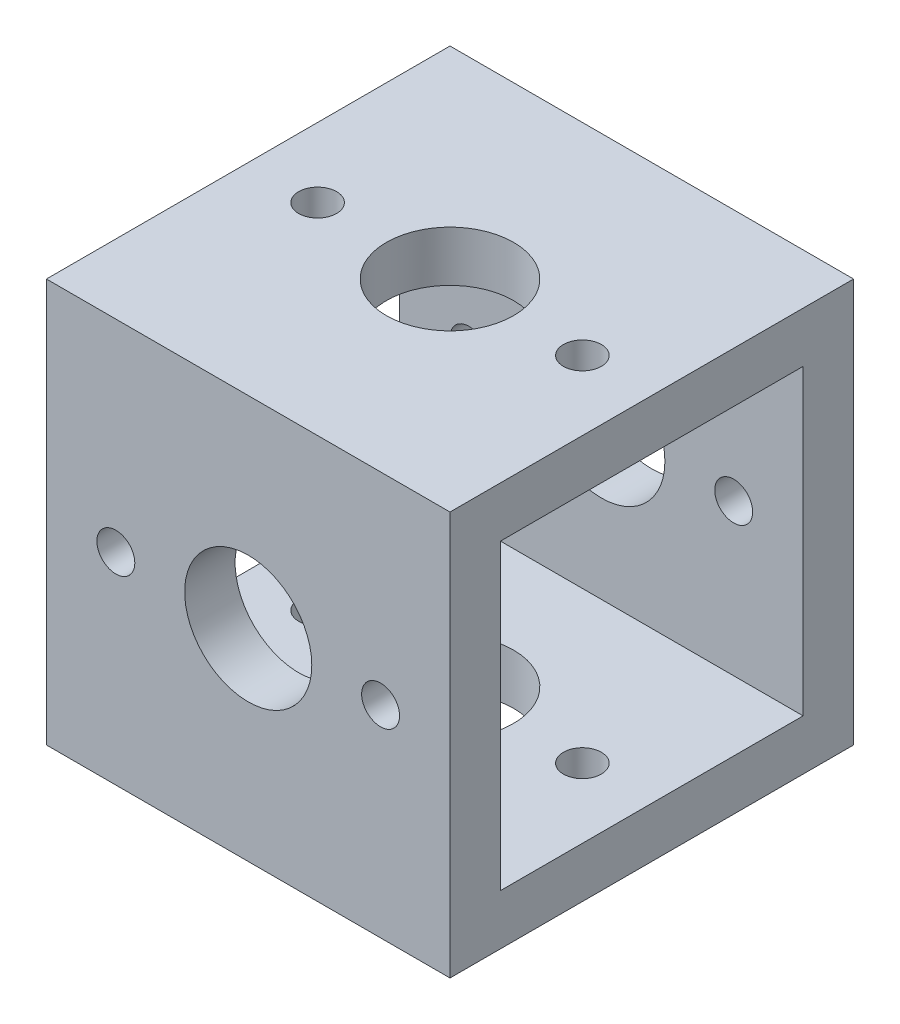
ISO-10303-21;
HEADER;
FILE_DESCRIPTION(('STEP AP214'),'2;1');
FILE_NAME('part.step','',(''),(''),'','','');
FILE_SCHEMA(('AUTOMOTIVE_DESIGN { 1 0 10303 214 1 1 1 1 }'));
ENDSEC;
DATA;
#1=APPLICATION_CONTEXT('core data for automotive mechanical design processes');
#2=APPLICATION_PROTOCOL_DEFINITION('international standard','automotive_design',2000,#1);
#3=PRODUCT_CONTEXT('',#1,'mechanical');
#4=PRODUCT('Part','Part','',(#3));
#5=PRODUCT_RELATED_PRODUCT_CATEGORY('part','',(#4));
#6=PRODUCT_DEFINITION_FORMATION('','',#4);
#7=PRODUCT_DEFINITION_CONTEXT('part definition',#1,'design');
#8=PRODUCT_DEFINITION('design','',#6,#7);
#9=PRODUCT_DEFINITION_SHAPE('','',#8);
#10=(LENGTH_UNIT() NAMED_UNIT(*) SI_UNIT(.MILLI.,.METRE.));
#11=(NAMED_UNIT(*) PLANE_ANGLE_UNIT() SI_UNIT($,.RADIAN.));
#12=(NAMED_UNIT(*) SI_UNIT($,.STERADIAN.) SOLID_ANGLE_UNIT());
#13=UNCERTAINTY_MEASURE_WITH_UNIT(LENGTH_MEASURE(1.E-05),#10,'distance_accuracy_value','');
#14=(GEOMETRIC_REPRESENTATION_CONTEXT(3) GLOBAL_UNCERTAINTY_ASSIGNED_CONTEXT((#13)) GLOBAL_UNIT_ASSIGNED_CONTEXT((#10,
#11,#12)) REPRESENTATION_CONTEXT('',''));
#15=CARTESIAN_POINT('',(0.,0.,0.));
#16=DIRECTION('',(0.,0.,1.));
#17=DIRECTION('',(1.,0.,0.));
#18=AXIS2_PLACEMENT_3D('',#15,#16,#17);
#19=CARTESIAN_POINT('',(25.4,11.9126,2.3876));
#20=DIRECTION('',(0.,0.,1.));
#21=DIRECTION('',(1.,0.,0.));
#22=AXIS2_PLACEMENT_3D('',#19,#20,#21);
#23=PLANE('',#22);
#24=CARTESIAN_POINT('',(21.0312,11.9126,2.3876));
#25=DIRECTION('',(0.,0.,1.));
#26=DIRECTION('',(1.,0.,0.));
#27=AXIS2_PLACEMENT_3D('',#24,#25,#26);
#28=CIRCLE('',#27,1.1938);
#29=CARTESIAN_POINT('',(22.225,11.9126,2.3876));
#30=VERTEX_POINT('',#29);
#31=EDGE_CURVE('E259',#30,#30,#28,.F.);
#32=ORIENTED_EDGE('',*,*,#31,.T.);
#33=EDGE_LOOP('',(#32));
#34=FACE_BOUND('',#33,.T.);
#35=DIRECTION('',(0.,1.,0.));
#36=VECTOR('',#35,1.);
#37=CARTESIAN_POINT('',(0.,11.9126,2.3876));
#38=LINE('',#37,#36);
#39=CARTESIAN_POINT('',(0.,2.3876,2.3876));
#40=VERTEX_POINT('',#39);
#41=CARTESIAN_POINT('',(0.,21.4376,2.3876));
#42=VERTEX_POINT('',#41);
#43=EDGE_CURVE('E130',#40,#42,#38,.T.);
#44=ORIENTED_EDGE('',*,*,#43,.F.);
#45=DIRECTION('',(-1.,0.,0.));
#46=VECTOR('',#45,1.);
#47=CARTESIAN_POINT('',(25.4,2.3876,2.3876));
#48=LINE('',#47,#46);
#49=CARTESIAN_POINT('',(25.4,2.3876,2.3876));
#50=VERTEX_POINT('',#49);
#51=EDGE_CURVE('E11',#50,#40,#48,.T.);
#52=ORIENTED_EDGE('',*,*,#51,.F.);
#53=DIRECTION('',(0.,1.,0.));
#54=VECTOR('',#53,1.);
#55=CARTESIAN_POINT('',(25.4,11.9126,2.3876));
#56=LINE('',#55,#54);
#57=CARTESIAN_POINT('',(25.4,21.4376,2.3876));
#58=VERTEX_POINT('',#57);
#59=EDGE_CURVE('E150',#50,#58,#56,.T.);
#60=ORIENTED_EDGE('',*,*,#59,.T.);
#61=DIRECTION('',(-1.,0.,0.));
#62=VECTOR('',#61,1.);
#63=CARTESIAN_POINT('',(25.4,21.4376,2.3876));
#64=LINE('',#63,#62);
#65=EDGE_CURVE('E43',#58,#42,#64,.T.);
#66=ORIENTED_EDGE('',*,*,#65,.T.);
#67=EDGE_LOOP('',(#44,#52,#60,#66));
#68=FACE_BOUND('',#67,.T.);
#69=CARTESIAN_POINT('',(12.7,11.9126,2.3876));
#70=DIRECTION('',(0.,0.,1.));
#71=DIRECTION('',(1.,0.,0.));
#72=AXIS2_PLACEMENT_3D('',#69,#70,#71);
#73=CIRCLE('',#72,4.0005);
#74=CARTESIAN_POINT('',(16.7005,11.9126,2.3876));
#75=VERTEX_POINT('',#74);
#76=EDGE_CURVE('E276',#75,#75,#73,.F.);
#77=ORIENTED_EDGE('',*,*,#76,.T.);
#78=EDGE_LOOP('',(#77));
#79=FACE_BOUND('',#78,.T.);
#80=CARTESIAN_POINT('',(4.3688,11.9126,2.3876));
#81=DIRECTION('',(0.,0.,1.));
#82=DIRECTION('',(1.,0.,0.));
#83=AXIS2_PLACEMENT_3D('',#80,#81,#82);
#84=CIRCLE('',#83,1.1938);
#85=CARTESIAN_POINT('',(5.5626,11.9126,2.3876));
#86=VERTEX_POINT('',#85);
#87=EDGE_CURVE('E262',#86,#86,#84,.F.);
#88=ORIENTED_EDGE('',*,*,#87,.T.);
#89=EDGE_LOOP('',(#88));
#90=FACE_BOUND('',#89,.T.);
#91=ADVANCED_FACE('F26',(#34,#68,#79,#90),#23,.T.);
#92=CARTESIAN_POINT('',(25.4,11.9126,21.4376));
#93=DIRECTION('',(0.,0.,1.));
#94=DIRECTION('',(1.,0.,0.));
#95=AXIS2_PLACEMENT_3D('',#92,#93,#94);
#96=PLANE('',#95);
#97=CARTESIAN_POINT('',(21.0312,11.9126,21.4376));
#98=DIRECTION('',(0.,0.,1.));
#99=DIRECTION('',(1.,0.,0.));
#100=AXIS2_PLACEMENT_3D('',#97,#98,#99);
#101=CIRCLE('',#100,1.1938);
#102=CARTESIAN_POINT('',(22.225,11.9126,21.4376));
#103=VERTEX_POINT('',#102);
#104=EDGE_CURVE('E255',#103,#103,#101,.F.);
#105=ORIENTED_EDGE('',*,*,#104,.F.);
#106=EDGE_LOOP('',(#105));
#107=FACE_BOUND('',#106,.T.);
#108=DIRECTION('',(0.,1.,0.));
#109=VECTOR('',#108,1.);
#110=CARTESIAN_POINT('',(0.,11.9126,21.4376));
#111=LINE('',#110,#109);
#112=CARTESIAN_POINT('',(0.,2.3876,21.4376));
#113=VERTEX_POINT('',#112);
#114=CARTESIAN_POINT('',(0.,21.4376,21.4376));
#115=VERTEX_POINT('',#114);
#116=EDGE_CURVE('E136',#113,#115,#111,.T.);
#117=ORIENTED_EDGE('',*,*,#116,.T.);
#118=DIRECTION('',(-1.,0.,0.));
#119=VECTOR('',#118,1.);
#120=CARTESIAN_POINT('',(25.4,21.4376,21.4376));
#121=LINE('',#120,#119);
#122=CARTESIAN_POINT('',(25.4,21.4376,21.4376));
#123=VERTEX_POINT('',#122);
#124=EDGE_CURVE('E158',#123,#115,#121,.T.);
#125=ORIENTED_EDGE('',*,*,#124,.F.);
#126=DIRECTION('',(0.,1.,0.));
#127=VECTOR('',#126,1.);
#128=CARTESIAN_POINT('',(25.4,11.9126,21.4376));
#129=LINE('',#128,#127);
#130=CARTESIAN_POINT('',(25.4,2.3876,21.4376));
#131=VERTEX_POINT('',#130);
#132=EDGE_CURVE('E51',#131,#123,#129,.T.);
#133=ORIENTED_EDGE('',*,*,#132,.F.);
#134=DIRECTION('',(-1.,0.,0.));
#135=VECTOR('',#134,1.);
#136=CARTESIAN_POINT('',(25.4,2.3876,21.4376));
#137=LINE('',#136,#135);
#138=EDGE_CURVE('E35',#131,#113,#137,.T.);
#139=ORIENTED_EDGE('',*,*,#138,.T.);
#140=EDGE_LOOP('',(#117,#125,#133,#139));
#141=FACE_BOUND('',#140,.T.);
#142=CARTESIAN_POINT('',(12.7,11.9126,21.4376));
#143=DIRECTION('',(0.,0.,1.));
#144=DIRECTION('',(1.,0.,0.));
#145=AXIS2_PLACEMENT_3D('',#142,#143,#144);
#146=CIRCLE('',#145,4.0005);
#147=CARTESIAN_POINT('',(16.7005,11.9126,21.4376));
#148=VERTEX_POINT('',#147);
#149=EDGE_CURVE('E273',#148,#148,#146,.F.);
#150=ORIENTED_EDGE('',*,*,#149,.F.);
#151=EDGE_LOOP('',(#150));
#152=FACE_BOUND('',#151,.T.);
#153=CARTESIAN_POINT('',(4.3688,11.9126,21.4376));
#154=DIRECTION('',(0.,0.,1.));
#155=DIRECTION('',(1.,0.,0.));
#156=AXIS2_PLACEMENT_3D('',#153,#154,#155);
#157=CIRCLE('',#156,1.1938);
#158=CARTESIAN_POINT('',(5.5626,11.9126,21.4376));
#159=VERTEX_POINT('',#158);
#160=EDGE_CURVE('E325',#159,#159,#157,.F.);
#161=ORIENTED_EDGE('',*,*,#160,.F.);
#162=EDGE_LOOP('',(#161));
#163=FACE_BOUND('',#162,.T.);
#164=ADVANCED_FACE('F229',(#107,#141,#152,#163),#96,.F.);
#165=CARTESIAN_POINT('',(25.4,11.9126,-0.787399999999997));
#166=DIRECTION('',(0.,0.,1.));
#167=DIRECTION('',(0.,-1.,0.));
#168=AXIS2_PLACEMENT_3D('',#165,#166,#167);
#169=PLANE('',#168);
#170=CARTESIAN_POINT('',(21.0312,11.9126,-0.787399999999997));
#171=DIRECTION('',(0.,0.,1.));
#172=DIRECTION('',(0.,-1.,0.));
#173=AXIS2_PLACEMENT_3D('',#170,#171,#172);
#174=CIRCLE('',#173,1.1938);
#175=CARTESIAN_POINT('',(21.0312,10.7188,-0.787399999999997));
#176=VERTEX_POINT('',#175);
#177=EDGE_CURVE('E253',#176,#176,#174,.F.);
#178=ORIENTED_EDGE('',*,*,#177,.F.);
#179=EDGE_LOOP('',(#178));
#180=FACE_BOUND('',#179,.T.);
#181=DIRECTION('',(0.,1.,0.));
#182=VECTOR('',#181,1.);
#183=CARTESIAN_POINT('',(0.,11.9126,-0.787399999999997));
#184=LINE('',#183,#182);
#185=CARTESIAN_POINT('',(0.,-0.787399999999997,-0.787399999999997));
#186=VERTEX_POINT('',#185);
#187=CARTESIAN_POINT('',(0.,24.6126,-0.787399999999999));
#188=VERTEX_POINT('',#187);
#189=EDGE_CURVE('E98',#186,#188,#184,.T.);
#190=ORIENTED_EDGE('',*,*,#189,.T.);
#191=DIRECTION('',(-1.,0.,0.));
#192=VECTOR('',#191,1.);
#193=CARTESIAN_POINT('',(25.4,24.6126,-0.787399999999999));
#194=LINE('',#193,#192);
#195=CARTESIAN_POINT('',(25.4,24.6126,-0.787399999999999));
#196=VERTEX_POINT('',#195);
#197=EDGE_CURVE('E105',#196,#188,#194,.T.);
#198=ORIENTED_EDGE('',*,*,#197,.F.);
#199=DIRECTION('',(0.,1.,0.));
#200=VECTOR('',#199,1.);
#201=CARTESIAN_POINT('',(25.4,11.9126,-0.787399999999997));
#202=LINE('',#201,#200);
#203=CARTESIAN_POINT('',(25.4,-0.787399999999997,-0.787399999999997));
#204=VERTEX_POINT('',#203);
#205=EDGE_CURVE('E100',#204,#196,#202,.T.);
#206=ORIENTED_EDGE('',*,*,#205,.F.);
#207=DIRECTION('',(-1.,0.,0.));
#208=VECTOR('',#207,1.);
#209=CARTESIAN_POINT('',(25.4,-0.787399999999997,-0.787399999999997));
#210=LINE('',#209,#208);
#211=EDGE_CURVE('E93',#204,#186,#210,.T.);
#212=ORIENTED_EDGE('',*,*,#211,.T.);
#213=EDGE_LOOP('',(#190,#198,#206,#212));
#214=FACE_BOUND('',#213,.T.);
#215=CARTESIAN_POINT('',(12.7,11.9126,-0.787399999999997));
#216=DIRECTION('',(0.,0.,1.));
#217=DIRECTION('',(0.,-1.,0.));
#218=AXIS2_PLACEMENT_3D('',#215,#216,#217);
#219=CIRCLE('',#218,4.0005);
#220=CARTESIAN_POINT('',(12.7,7.9121,-0.787399999999997));
#221=VERTEX_POINT('',#220);
#222=EDGE_CURVE('E270',#221,#221,#219,.F.);
#223=ORIENTED_EDGE('',*,*,#222,.F.);
#224=EDGE_LOOP('',(#223));
#225=FACE_BOUND('',#224,.T.);
#226=CARTESIAN_POINT('',(4.3688,11.9126,-0.787399999999997));
#227=DIRECTION('',(0.,0.,1.));
#228=DIRECTION('',(0.,-1.,0.));
#229=AXIS2_PLACEMENT_3D('',#226,#227,#228);
#230=CIRCLE('',#229,1.1938);
#231=CARTESIAN_POINT('',(4.3688,10.7188,-0.787399999999997));
#232=VERTEX_POINT('',#231);
#233=EDGE_CURVE('E327',#232,#232,#230,.F.);
#234=ORIENTED_EDGE('',*,*,#233,.F.);
#235=EDGE_LOOP('',(#234));
#236=FACE_BOUND('',#235,.T.);
#237=ADVANCED_FACE('F95',(#180,#214,#225,#236),#169,.F.);
#238=CARTESIAN_POINT('',(25.4,11.9126,24.6126));
#239=DIRECTION('',(0.,0.,1.));
#240=DIRECTION('',(1.,0.,0.));
#241=AXIS2_PLACEMENT_3D('',#238,#239,#240);
#242=PLANE('',#241);
#243=CARTESIAN_POINT('',(21.0312,11.9126,24.6126));
#244=DIRECTION('',(0.,0.,1.));
#245=DIRECTION('',(1.,0.,0.));
#246=AXIS2_PLACEMENT_3D('',#243,#244,#245);
#247=CIRCLE('',#246,1.1938);
#248=CARTESIAN_POINT('',(22.225,11.9126,24.6126));
#249=VERTEX_POINT('',#248);
#250=EDGE_CURVE('E256',#249,#249,#247,.T.);
#251=ORIENTED_EDGE('',*,*,#250,.F.);
#252=EDGE_LOOP('',(#251));
#253=FACE_BOUND('',#252,.T.);
#254=DIRECTION('',(0.,1.,0.));
#255=VECTOR('',#254,1.);
#256=CARTESIAN_POINT('',(0.,11.9126,24.6126));
#257=LINE('',#256,#255);
#258=CARTESIAN_POINT('',(0.,-0.787400000000001,24.6126));
#259=VERTEX_POINT('',#258);
#260=CARTESIAN_POINT('',(0.,24.6126,24.6126));
#261=VERTEX_POINT('',#260);
#262=EDGE_CURVE('E128',#259,#261,#257,.T.);
#263=ORIENTED_EDGE('',*,*,#262,.F.);
#264=DIRECTION('',(-1.,0.,0.));
#265=VECTOR('',#264,1.);
#266=CARTESIAN_POINT('',(25.4,-0.787400000000001,24.6126));
#267=LINE('',#266,#265);
#268=CARTESIAN_POINT('',(25.4,-0.787400000000001,24.6126));
#269=VERTEX_POINT('',#268);
#270=EDGE_CURVE('E119',#269,#259,#267,.T.);
#271=ORIENTED_EDGE('',*,*,#270,.F.);
#272=DIRECTION('',(0.,1.,0.));
#273=VECTOR('',#272,1.);
#274=CARTESIAN_POINT('',(25.4,11.9126,24.6126));
#275=LINE('',#274,#273);
#276=CARTESIAN_POINT('',(25.4,24.6126,24.6126));
#277=VERTEX_POINT('',#276);
#278=EDGE_CURVE('E147',#269,#277,#275,.T.);
#279=ORIENTED_EDGE('',*,*,#278,.T.);
#280=DIRECTION('',(-1.,0.,0.));
#281=VECTOR('',#280,1.);
#282=CARTESIAN_POINT('',(25.4,24.6126,24.6126));
#283=LINE('',#282,#281);
#284=EDGE_CURVE('E163',#277,#261,#283,.T.);
#285=ORIENTED_EDGE('',*,*,#284,.T.);
#286=EDGE_LOOP('',(#263,#271,#279,#285));
#287=FACE_BOUND('',#286,.T.);
#288=CARTESIAN_POINT('',(12.7,11.9126,24.6126));
#289=DIRECTION('',(0.,0.,1.));
#290=DIRECTION('',(1.,0.,0.));
#291=AXIS2_PLACEMENT_3D('',#288,#289,#290);
#292=CIRCLE('',#291,4.0005);
#293=CARTESIAN_POINT('',(16.7005,11.9126,24.6126));
#294=VERTEX_POINT('',#293);
#295=EDGE_CURVE('E267',#294,#294,#292,.T.);
#296=ORIENTED_EDGE('',*,*,#295,.F.);
#297=EDGE_LOOP('',(#296));
#298=FACE_BOUND('',#297,.T.);
#299=CARTESIAN_POINT('',(4.3688,11.9126,24.6126));
#300=DIRECTION('',(0.,0.,1.));
#301=DIRECTION('',(1.,0.,0.));
#302=AXIS2_PLACEMENT_3D('',#299,#300,#301);
#303=CIRCLE('',#302,1.1938);
#304=CARTESIAN_POINT('',(5.5626,11.9126,24.6126));
#305=VERTEX_POINT('',#304);
#306=EDGE_CURVE('E331',#305,#305,#303,.T.);
#307=ORIENTED_EDGE('',*,*,#306,.F.);
#308=EDGE_LOOP('',(#307));
#309=FACE_BOUND('',#308,.T.);
#310=ADVANCED_FACE('F206',(#253,#287,#298,#309),#242,.T.);
#311=CARTESIAN_POINT('',(25.4,2.3876,-16.1688213562373));
#312=DIRECTION('',(0.,-1.,0.));
#313=DIRECTION('',(0.,0.,-1.));
#314=AXIS2_PLACEMENT_3D('',#311,#312,#313);
#315=PLANE('',#314);
#316=CARTESIAN_POINT('',(21.0312,2.3876,11.9126));
#317=DIRECTION('',(0.,-1.,0.));
#318=DIRECTION('',(0.,0.,-1.));
#319=AXIS2_PLACEMENT_3D('',#316,#317,#318);
#320=CIRCLE('',#319,1.1938);
#321=CARTESIAN_POINT('',(21.0312,2.3876,10.7188));
#322=VERTEX_POINT('',#321);
#323=EDGE_CURVE('E176',#322,#322,#320,.F.);
#324=ORIENTED_EDGE('',*,*,#323,.F.);
#325=EDGE_LOOP('',(#324));
#326=FACE_BOUND('',#325,.T.);
#327=DIRECTION('',(0.,0.,1.));
#328=VECTOR('',#327,1.);
#329=CARTESIAN_POINT('',(0.,2.3876,-16.1688213562373));
#330=LINE('',#329,#328);
#331=EDGE_CURVE('E133',#40,#113,#330,.T.);
#332=ORIENTED_EDGE('',*,*,#331,.T.);
#333=ORIENTED_EDGE('',*,*,#138,.F.);
#334=DIRECTION('',(0.,0.,1.));
#335=VECTOR('',#334,1.);
#336=CARTESIAN_POINT('',(25.4,2.3876,-16.1688213562373));
#337=LINE('',#336,#335);
#338=EDGE_CURVE('E152',#50,#131,#337,.T.);
#339=ORIENTED_EDGE('',*,*,#338,.F.);
#340=ORIENTED_EDGE('',*,*,#51,.T.);
#341=EDGE_LOOP('',(#332,#333,#339,#340));
#342=FACE_BOUND('',#341,.T.);
#343=CARTESIAN_POINT('',(12.7,2.3876,11.9126));
#344=DIRECTION('',(0.,-1.,0.));
#345=DIRECTION('',(0.,0.,-1.));
#346=AXIS2_PLACEMENT_3D('',#343,#344,#345);
#347=CIRCLE('',#346,4.0005);
#348=CARTESIAN_POINT('',(12.7,2.3876,7.9121));
#349=VERTEX_POINT('',#348);
#350=EDGE_CURVE('E120',#349,#349,#347,.F.);
#351=ORIENTED_EDGE('',*,*,#350,.F.);
#352=EDGE_LOOP('',(#351));
#353=FACE_BOUND('',#352,.T.);
#354=CARTESIAN_POINT('',(4.3688,2.3876,11.9126));
#355=DIRECTION('',(0.,-1.,0.));
#356=DIRECTION('',(0.,0.,-1.));
#357=AXIS2_PLACEMENT_3D('',#354,#355,#356);
#358=CIRCLE('',#357,1.1938);
#359=CARTESIAN_POINT('',(4.3688,2.3876,10.7188));
#360=VERTEX_POINT('',#359);
#361=EDGE_CURVE('E179',#360,#360,#358,.F.);
#362=ORIENTED_EDGE('',*,*,#361,.F.);
#363=EDGE_LOOP('',(#362));
#364=FACE_BOUND('',#363,.T.);
#365=ADVANCED_FACE('F203',(#326,#342,#353,#364),#315,.F.);
#366=CARTESIAN_POINT('',(25.4,-0.787399999999995,-16.1688213562373));
#367=DIRECTION('',(0.,-1.,0.));
#368=DIRECTION('',(0.,0.,-1.));
#369=AXIS2_PLACEMENT_3D('',#366,#367,#368);
#370=PLANE('',#369);
#371=CARTESIAN_POINT('',(21.0312,-0.787400000000001,11.9126));
#372=DIRECTION('',(0.,-1.,0.));
#373=DIRECTION('',(0.,0.,-1.));
#374=AXIS2_PLACEMENT_3D('',#371,#372,#373);
#375=CIRCLE('',#374,1.1938);
#376=CARTESIAN_POINT('',(21.0312,-0.787400000000001,10.7188));
#377=VERTEX_POINT('',#376);
#378=EDGE_CURVE('E171',#377,#377,#375,.F.);
#379=ORIENTED_EDGE('',*,*,#378,.T.);
#380=EDGE_LOOP('',(#379));
#381=FACE_BOUND('',#380,.T.);
#382=DIRECTION('',(0.,0.,1.));
#383=VECTOR('',#382,1.);
#384=CARTESIAN_POINT('',(0.,-0.787399999999995,-16.1688213562373));
#385=LINE('',#384,#383);
#386=EDGE_CURVE('E113',#186,#259,#385,.T.);
#387=ORIENTED_EDGE('',*,*,#386,.F.);
#388=ORIENTED_EDGE('',*,*,#211,.F.);
#389=DIRECTION('',(0.,0.,1.));
#390=VECTOR('',#389,1.);
#391=CARTESIAN_POINT('',(25.4,-0.787399999999995,-16.1688213562373));
#392=LINE('',#391,#390);
#393=EDGE_CURVE('E142',#204,#269,#392,.T.);
#394=ORIENTED_EDGE('',*,*,#393,.T.);
#395=ORIENTED_EDGE('',*,*,#270,.T.);
#396=EDGE_LOOP('',(#387,#388,#394,#395));
#397=FACE_BOUND('',#396,.T.);
#398=CARTESIAN_POINT('',(12.7,-0.787400000000001,11.9126));
#399=DIRECTION('',(0.,-1.,0.));
#400=DIRECTION('',(0.,0.,-1.));
#401=AXIS2_PLACEMENT_3D('',#398,#399,#400);
#402=CIRCLE('',#401,4.0005);
#403=CARTESIAN_POINT('',(12.7,-0.7874,7.9121));
#404=VERTEX_POINT('',#403);
#405=EDGE_CURVE('E123',#404,#404,#402,.F.);
#406=ORIENTED_EDGE('',*,*,#405,.T.);
#407=EDGE_LOOP('',(#406));
#408=FACE_BOUND('',#407,.T.);
#409=CARTESIAN_POINT('',(4.3688,-0.787400000000001,11.9126));
#410=DIRECTION('',(0.,-1.,0.));
#411=DIRECTION('',(0.,0.,-1.));
#412=AXIS2_PLACEMENT_3D('',#409,#410,#411);
#413=CIRCLE('',#412,1.1938);
#414=CARTESIAN_POINT('',(4.3688,-0.787400000000001,10.7188));
#415=VERTEX_POINT('',#414);
#416=EDGE_CURVE('E184',#415,#415,#413,.F.);
#417=ORIENTED_EDGE('',*,*,#416,.T.);
#418=EDGE_LOOP('',(#417));
#419=FACE_BOUND('',#418,.T.);
#420=ADVANCED_FACE('F28',(#381,#397,#408,#419),#370,.T.);
#421=CARTESIAN_POINT('',(25.4,24.6126,-16.1688213562373));
#422=DIRECTION('',(0.,-1.,0.));
#423=DIRECTION('',(0.,0.,-1.));
#424=AXIS2_PLACEMENT_3D('',#421,#422,#423);
#425=PLANE('',#424);
#426=CARTESIAN_POINT('',(21.0312,24.6126,11.9126));
#427=DIRECTION('',(0.,1.,0.));
#428=DIRECTION('',(0.,0.,1.));
#429=AXIS2_PLACEMENT_3D('',#426,#427,#428);
#430=CIRCLE('',#429,1.1938);
#431=CARTESIAN_POINT('',(21.0312,24.6126,13.1064));
#432=VERTEX_POINT('',#431);
#433=EDGE_CURVE('E172',#432,#432,#430,.T.);
#434=ORIENTED_EDGE('',*,*,#433,.F.);
#435=EDGE_LOOP('',(#434));
#436=FACE_BOUND('',#435,.T.);
#437=DIRECTION('',(0.,0.,1.));
#438=VECTOR('',#437,1.);
#439=CARTESIAN_POINT('',(0.,24.6126,-16.1688213562373));
#440=LINE('',#439,#438);
#441=EDGE_CURVE('E116',#188,#261,#440,.T.);
#442=ORIENTED_EDGE('',*,*,#441,.T.);
#443=ORIENTED_EDGE('',*,*,#284,.F.);
#444=DIRECTION('',(0.,0.,1.));
#445=VECTOR('',#444,1.);
#446=CARTESIAN_POINT('',(25.4,24.6126,-16.1688213562373));
#447=LINE('',#446,#445);
#448=EDGE_CURVE('E145',#196,#277,#447,.T.);
#449=ORIENTED_EDGE('',*,*,#448,.F.);
#450=ORIENTED_EDGE('',*,*,#197,.T.);
#451=EDGE_LOOP('',(#442,#443,#449,#450));
#452=FACE_BOUND('',#451,.T.);
#453=CARTESIAN_POINT('',(12.7,24.6126,11.9126));
#454=DIRECTION('',(0.,1.,0.));
#455=DIRECTION('',(0.,0.,1.));
#456=AXIS2_PLACEMENT_3D('',#453,#454,#455);
#457=CIRCLE('',#456,4.0005);
#458=CARTESIAN_POINT('',(12.7,24.6126,15.9131));
#459=VERTEX_POINT('',#458);
#460=EDGE_CURVE('E168',#459,#459,#457,.T.);
#461=ORIENTED_EDGE('',*,*,#460,.F.);
#462=EDGE_LOOP('',(#461));
#463=FACE_BOUND('',#462,.T.);
#464=CARTESIAN_POINT('',(4.3688,24.6126,11.9126));
#465=DIRECTION('',(0.,1.,0.));
#466=DIRECTION('',(0.,0.,1.));
#467=AXIS2_PLACEMENT_3D('',#464,#465,#466);
#468=CIRCLE('',#467,1.1938);
#469=CARTESIAN_POINT('',(4.3688,24.6126,13.1064));
#470=VERTEX_POINT('',#469);
#471=EDGE_CURVE('E279',#470,#470,#468,.T.);
#472=ORIENTED_EDGE('',*,*,#471,.F.);
#473=EDGE_LOOP('',(#472));
#474=FACE_BOUND('',#473,.T.);
#475=ADVANCED_FACE('F243',(#436,#452,#463,#474),#425,.F.);
#476=CARTESIAN_POINT('',(25.4,21.4376,-16.1688213562373));
#477=DIRECTION('',(0.,-1.,0.));
#478=DIRECTION('',(0.,0.,-1.));
#479=AXIS2_PLACEMENT_3D('',#476,#477,#478);
#480=PLANE('',#479);
#481=CARTESIAN_POINT('',(21.0312,21.4376,11.9126));
#482=DIRECTION('',(0.,-1.,0.));
#483=DIRECTION('',(0.,0.,-1.));
#484=AXIS2_PLACEMENT_3D('',#481,#482,#483);
#485=CIRCLE('',#484,1.1938);
#486=CARTESIAN_POINT('',(21.0312,21.4376,10.7188));
#487=VERTEX_POINT('',#486);
#488=EDGE_CURVE('E169',#487,#487,#485,.F.);
#489=ORIENTED_EDGE('',*,*,#488,.T.);
#490=EDGE_LOOP('',(#489));
#491=FACE_BOUND('',#490,.T.);
#492=DIRECTION('',(0.,0.,1.));
#493=VECTOR('',#492,1.);
#494=CARTESIAN_POINT('',(0.,21.4376,-16.1688213562373));
#495=LINE('',#494,#493);
#496=EDGE_CURVE('E139',#42,#115,#495,.T.);
#497=ORIENTED_EDGE('',*,*,#496,.F.);
#498=ORIENTED_EDGE('',*,*,#65,.F.);
#499=DIRECTION('',(0.,0.,1.));
#500=VECTOR('',#499,1.);
#501=CARTESIAN_POINT('',(25.4,21.4376,-16.1688213562373));
#502=LINE('',#501,#500);
#503=EDGE_CURVE('E155',#58,#123,#502,.T.);
#504=ORIENTED_EDGE('',*,*,#503,.T.);
#505=ORIENTED_EDGE('',*,*,#124,.T.);
#506=EDGE_LOOP('',(#497,#498,#504,#505));
#507=FACE_BOUND('',#506,.T.);
#508=CARTESIAN_POINT('',(12.7,21.4376,11.9126));
#509=DIRECTION('',(0.,-1.,0.));
#510=DIRECTION('',(0.,0.,-1.));
#511=AXIS2_PLACEMENT_3D('',#508,#509,#510);
#512=CIRCLE('',#511,4.0005);
#513=CARTESIAN_POINT('',(12.7,21.4376,7.9121));
#514=VERTEX_POINT('',#513);
#515=EDGE_CURVE('E166',#514,#514,#512,.F.);
#516=ORIENTED_EDGE('',*,*,#515,.T.);
#517=EDGE_LOOP('',(#516));
#518=FACE_BOUND('',#517,.T.);
#519=CARTESIAN_POINT('',(4.3688,21.4376,11.9126));
#520=DIRECTION('',(0.,-1.,0.));
#521=DIRECTION('',(0.,0.,-1.));
#522=AXIS2_PLACEMENT_3D('',#519,#520,#521);
#523=CIRCLE('',#522,1.1938);
#524=CARTESIAN_POINT('',(4.3688,21.4376,10.7188));
#525=VERTEX_POINT('',#524);
#526=EDGE_CURVE('E30',#525,#525,#523,.F.);
#527=ORIENTED_EDGE('',*,*,#526,.T.);
#528=EDGE_LOOP('',(#527));
#529=FACE_BOUND('',#528,.T.);
#530=ADVANCED_FACE('F245',(#491,#507,#518,#529),#480,.T.);
#531=CARTESIAN_POINT('',(25.4,11.9126,-16.1688213562373));
#532=DIRECTION('',(1.,0.,0.));
#533=DIRECTION('',(0.,0.,-1.));
#534=AXIS2_PLACEMENT_3D('',#531,#532,#533);
#535=PLANE('',#534);
#536=ORIENTED_EDGE('',*,*,#393,.F.);
#537=ORIENTED_EDGE('',*,*,#205,.T.);
#538=ORIENTED_EDGE('',*,*,#448,.T.);
#539=ORIENTED_EDGE('',*,*,#278,.F.);
#540=EDGE_LOOP('',(#536,#537,#538,#539));
#541=FACE_BOUND('',#540,.T.);
#542=ORIENTED_EDGE('',*,*,#59,.F.);
#543=ORIENTED_EDGE('',*,*,#338,.T.);
#544=ORIENTED_EDGE('',*,*,#132,.T.);
#545=ORIENTED_EDGE('',*,*,#503,.F.);
#546=EDGE_LOOP('',(#542,#543,#544,#545));
#547=FACE_BOUND('',#546,.T.);
#548=ADVANCED_FACE('F289',(#541,#547),#535,.T.);
#549=CARTESIAN_POINT('',(0.,11.9126,-16.1688213562373));
#550=DIRECTION('',(1.,0.,0.));
#551=DIRECTION('',(0.,0.,-1.));
#552=AXIS2_PLACEMENT_3D('',#549,#550,#551);
#553=PLANE('',#552);
#554=ORIENTED_EDGE('',*,*,#386,.T.);
#555=ORIENTED_EDGE('',*,*,#262,.T.);
#556=ORIENTED_EDGE('',*,*,#441,.F.);
#557=ORIENTED_EDGE('',*,*,#189,.F.);
#558=EDGE_LOOP('',(#554,#555,#556,#557));
#559=FACE_BOUND('',#558,.T.);
#560=ORIENTED_EDGE('',*,*,#43,.T.);
#561=ORIENTED_EDGE('',*,*,#496,.T.);
#562=ORIENTED_EDGE('',*,*,#116,.F.);
#563=ORIENTED_EDGE('',*,*,#331,.F.);
#564=EDGE_LOOP('',(#560,#561,#562,#563));
#565=FACE_BOUND('',#564,.T.);
#566=ADVANCED_FACE('F110',(#559,#565),#553,.F.);
#567=CARTESIAN_POINT('',(12.7,24.6126,11.9126));
#568=DIRECTION('',(0.,-1.,0.));
#569=DIRECTION('',(0.,0.,-1.));
#570=AXIS2_PLACEMENT_3D('',#567,#568,#569);
#571=CYLINDRICAL_SURFACE('',#570,4.0005);
#572=ORIENTED_EDGE('',*,*,#515,.F.);
#573=EDGE_LOOP('',(#572));
#574=FACE_BOUND('',#573,.T.);
#575=ORIENTED_EDGE('',*,*,#460,.T.);
#576=EDGE_LOOP('',(#575));
#577=FACE_BOUND('',#576,.T.);
#578=ADVANCED_FACE('F199',(#574,#577),#571,.F.);
#579=ORIENTED_EDGE('',*,*,#405,.F.);
#580=EDGE_LOOP('',(#579));
#581=FACE_BOUND('',#580,.T.);
#582=ORIENTED_EDGE('',*,*,#350,.T.);
#583=EDGE_LOOP('',(#582));
#584=FACE_BOUND('',#583,.T.);
#585=ADVANCED_FACE('F195',(#581,#584),#571,.F.);
#586=CARTESIAN_POINT('',(21.0312,24.6126,11.9126));
#587=DIRECTION('',(0.,-1.,0.));
#588=DIRECTION('',(0.,0.,-1.));
#589=AXIS2_PLACEMENT_3D('',#586,#587,#588);
#590=CYLINDRICAL_SURFACE('',#589,1.1938);
#591=ORIENTED_EDGE('',*,*,#488,.F.);
#592=EDGE_LOOP('',(#591));
#593=FACE_BOUND('',#592,.T.);
#594=ORIENTED_EDGE('',*,*,#433,.T.);
#595=EDGE_LOOP('',(#594));
#596=FACE_BOUND('',#595,.T.);
#597=ADVANCED_FACE('F198',(#593,#596),#590,.F.);
#598=ORIENTED_EDGE('',*,*,#378,.F.);
#599=EDGE_LOOP('',(#598));
#600=FACE_BOUND('',#599,.T.);
#601=ORIENTED_EDGE('',*,*,#323,.T.);
#602=EDGE_LOOP('',(#601));
#603=FACE_BOUND('',#602,.T.);
#604=ADVANCED_FACE('F225',(#600,#603),#590,.F.);
#605=CARTESIAN_POINT('',(4.3688,24.6126,11.9126));
#606=DIRECTION('',(0.,-1.,0.));
#607=DIRECTION('',(0.,0.,-1.));
#608=AXIS2_PLACEMENT_3D('',#605,#606,#607);
#609=CYLINDRICAL_SURFACE('',#608,1.1938);
#610=ORIENTED_EDGE('',*,*,#526,.F.);
#611=EDGE_LOOP('',(#610));
#612=FACE_BOUND('',#611,.T.);
#613=ORIENTED_EDGE('',*,*,#471,.T.);
#614=EDGE_LOOP('',(#613));
#615=FACE_BOUND('',#614,.T.);
#616=ADVANCED_FACE('F214',(#612,#615),#609,.F.);
#617=ORIENTED_EDGE('',*,*,#416,.F.);
#618=EDGE_LOOP('',(#617));
#619=FACE_BOUND('',#618,.T.);
#620=ORIENTED_EDGE('',*,*,#361,.T.);
#621=EDGE_LOOP('',(#620));
#622=FACE_BOUND('',#621,.T.);
#623=ADVANCED_FACE('F211',(#619,#622),#609,.F.);
#624=CARTESIAN_POINT('',(12.7,11.9126,24.6126));
#625=DIRECTION('',(0.,0.,-1.));
#626=DIRECTION('',(-1.,0.,0.));
#627=AXIS2_PLACEMENT_3D('',#624,#625,#626);
#628=CYLINDRICAL_SURFACE('',#627,4.0005);
#629=ORIENTED_EDGE('',*,*,#295,.T.);
#630=EDGE_LOOP('',(#629));
#631=FACE_BOUND('',#630,.T.);
#632=ORIENTED_EDGE('',*,*,#149,.T.);
#633=EDGE_LOOP('',(#632));
#634=FACE_BOUND('',#633,.T.);
#635=ADVANCED_FACE('F213',(#631,#634),#628,.F.);
#636=ORIENTED_EDGE('',*,*,#76,.F.);
#637=EDGE_LOOP('',(#636));
#638=FACE_BOUND('',#637,.T.);
#639=ORIENTED_EDGE('',*,*,#222,.T.);
#640=EDGE_LOOP('',(#639));
#641=FACE_BOUND('',#640,.T.);
#642=ADVANCED_FACE('F222',(#638,#641),#628,.F.);
#643=CARTESIAN_POINT('',(21.0312,11.9126,24.6126));
#644=DIRECTION('',(0.,0.,-1.));
#645=DIRECTION('',(-1.,0.,0.));
#646=AXIS2_PLACEMENT_3D('',#643,#644,#645);
#647=CYLINDRICAL_SURFACE('',#646,1.1938);
#648=ORIENTED_EDGE('',*,*,#250,.T.);
#649=EDGE_LOOP('',(#648));
#650=FACE_BOUND('',#649,.T.);
#651=ORIENTED_EDGE('',*,*,#104,.T.);
#652=EDGE_LOOP('',(#651));
#653=FACE_BOUND('',#652,.T.);
#654=ADVANCED_FACE('F348',(#650,#653),#647,.F.);
#655=ORIENTED_EDGE('',*,*,#31,.F.);
#656=EDGE_LOOP('',(#655));
#657=FACE_BOUND('',#656,.T.);
#658=ORIENTED_EDGE('',*,*,#177,.T.);
#659=EDGE_LOOP('',(#658));
#660=FACE_BOUND('',#659,.T.);
#661=ADVANCED_FACE('F341',(#657,#660),#647,.F.);
#662=CARTESIAN_POINT('',(4.3688,11.9126,24.6126));
#663=DIRECTION('',(0.,0.,-1.));
#664=DIRECTION('',(-1.,0.,0.));
#665=AXIS2_PLACEMENT_3D('',#662,#663,#664);
#666=CYLINDRICAL_SURFACE('',#665,1.1938);
#667=ORIENTED_EDGE('',*,*,#306,.T.);
#668=EDGE_LOOP('',(#667));
#669=FACE_BOUND('',#668,.T.);
#670=ORIENTED_EDGE('',*,*,#160,.T.);
#671=EDGE_LOOP('',(#670));
#672=FACE_BOUND('',#671,.T.);
#673=ADVANCED_FACE('F337',(#669,#672),#666,.F.);
#674=ORIENTED_EDGE('',*,*,#87,.F.);
#675=EDGE_LOOP('',(#674));
#676=FACE_BOUND('',#675,.T.);
#677=ORIENTED_EDGE('',*,*,#233,.T.);
#678=EDGE_LOOP('',(#677));
#679=FACE_BOUND('',#678,.T.);
#680=ADVANCED_FACE('F340',(#676,#679),#666,.F.);
#681=CLOSED_SHELL('',(#91,#164,#237,#310,#365,#420,#475,#530,#548,#566,#578,#585,#597,#604,#616,
#623,#635,#642,#654,#661,#673,#680));
#682=MANIFOLD_SOLID_BREP('B2',#681);
#683=ADVANCED_BREP_SHAPE_REPRESENTATION('',(#18,#682),#14);
#684=SHAPE_DEFINITION_REPRESENTATION(#9,#683);
ENDSEC;
END-ISO-10303-21;
